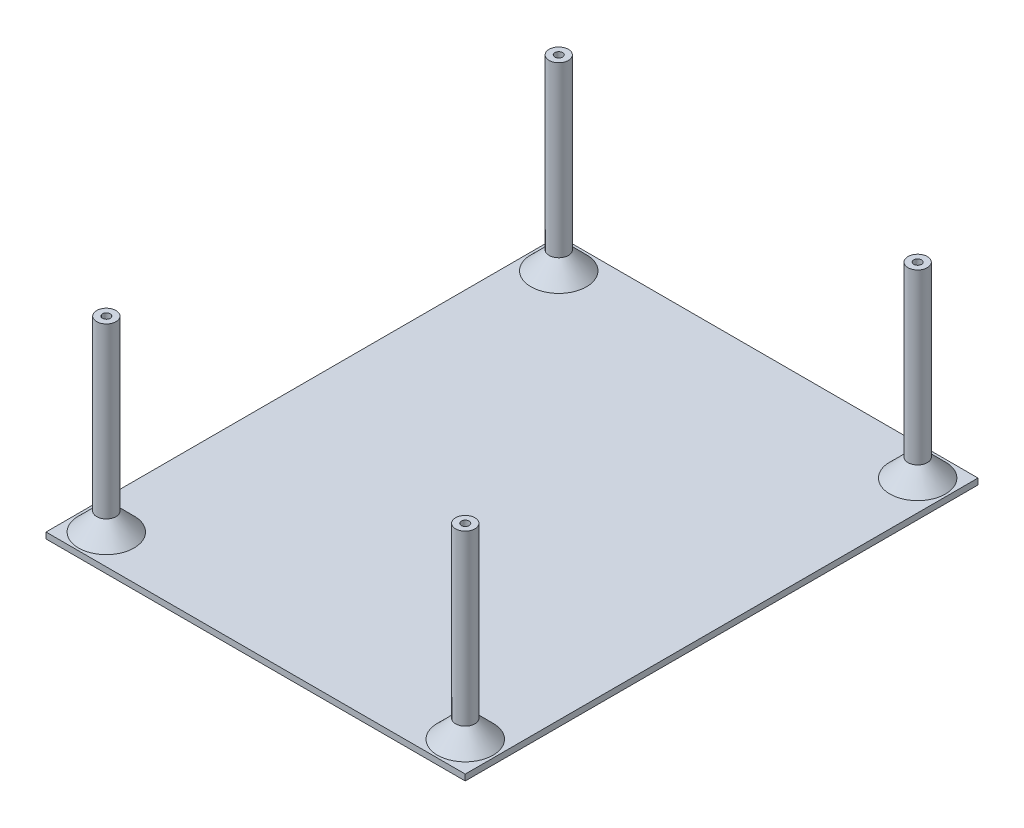
ISO-10303-21;
HEADER;
FILE_DESCRIPTION(('STEP AP214'),'2;1');
FILE_NAME('part.step','',(''),(''),'','','');
FILE_SCHEMA(('AUTOMOTIVE_DESIGN { 1 0 10303 214 1 1 1 1 }'));
ENDSEC;
DATA;
#1=APPLICATION_CONTEXT('core data for automotive mechanical design processes');
#2=APPLICATION_PROTOCOL_DEFINITION('international standard','automotive_design',2000,#1);
#3=PRODUCT_CONTEXT('',#1,'mechanical');
#4=PRODUCT('Part','Part','',(#3));
#5=PRODUCT_RELATED_PRODUCT_CATEGORY('part','',(#4));
#6=PRODUCT_DEFINITION_FORMATION('','',#4);
#7=PRODUCT_DEFINITION_CONTEXT('part definition',#1,'design');
#8=PRODUCT_DEFINITION('design','',#6,#7);
#9=PRODUCT_DEFINITION_SHAPE('','',#8);
#10=(LENGTH_UNIT() NAMED_UNIT(*) SI_UNIT(.MILLI.,.METRE.));
#11=(NAMED_UNIT(*) PLANE_ANGLE_UNIT() SI_UNIT($,.RADIAN.));
#12=(NAMED_UNIT(*) SI_UNIT($,.STERADIAN.) SOLID_ANGLE_UNIT());
#13=UNCERTAINTY_MEASURE_WITH_UNIT(LENGTH_MEASURE(1.E-05),#10,'distance_accuracy_value','');
#14=(GEOMETRIC_REPRESENTATION_CONTEXT(3) GLOBAL_UNCERTAINTY_ASSIGNED_CONTEXT((#13)) GLOBAL_UNIT_ASSIGNED_CONTEXT((#10,
#11,#12)) REPRESENTATION_CONTEXT('',''));
#15=CARTESIAN_POINT('',(0.,0.,0.));
#16=DIRECTION('',(0.,0.,1.));
#17=DIRECTION('',(1.,0.,0.));
#18=AXIS2_PLACEMENT_3D('',#15,#16,#17);
#19=CARTESIAN_POINT('',(-28.6506550218341,1.,-32.806768558952));
#20=DIRECTION('',(1.,0.,0.));
#21=DIRECTION('',(0.,0.,-1.));
#22=AXIS2_PLACEMENT_3D('',#19,#20,#21);
#23=PLANE('',#22);
#24=DIRECTION('',(0.,0.,1.));
#25=VECTOR('',#24,1.);
#26=CARTESIAN_POINT('',(-28.6506550218341,0.,-32.806768558952));
#27=LINE('',#26,#25);
#28=CARTESIAN_POINT('',(-28.6506550218341,0.,-32.806768558952));
#29=VERTEX_POINT('',#28);
#30=CARTESIAN_POINT('',(-28.650655021834,0.,52.193231441048));
#31=VERTEX_POINT('',#30);
#32=EDGE_CURVE('E104',#29,#31,#27,.T.);
#33=ORIENTED_EDGE('',*,*,#32,.T.);
#34=DIRECTION('',(0.,-1.,0.));
#35=VECTOR('',#34,1.);
#36=CARTESIAN_POINT('',(-28.650655021834,1.,52.193231441048));
#37=LINE('',#36,#35);
#38=CARTESIAN_POINT('',(-28.650655021834,1.,52.193231441048));
#39=VERTEX_POINT('',#38);
#40=EDGE_CURVE('E95',#39,#31,#37,.T.);
#41=ORIENTED_EDGE('',*,*,#40,.F.);
#42=DIRECTION('',(0.,0.,1.));
#43=VECTOR('',#42,1.);
#44=CARTESIAN_POINT('',(-28.6506550218341,1.,-32.806768558952));
#45=LINE('',#44,#43);
#46=CARTESIAN_POINT('',(-28.6506550218341,1.,-32.806768558952));
#47=VERTEX_POINT('',#46);
#48=EDGE_CURVE('E89',#47,#39,#45,.T.);
#49=ORIENTED_EDGE('',*,*,#48,.F.);
#50=DIRECTION('',(0.,-1.,0.));
#51=VECTOR('',#50,1.);
#52=CARTESIAN_POINT('',(-28.6506550218341,1.,-32.806768558952));
#53=LINE('',#52,#51);
#54=EDGE_CURVE('E100',#47,#29,#53,.T.);
#55=ORIENTED_EDGE('',*,*,#54,.T.);
#56=EDGE_LOOP('',(#33,#41,#49,#55));
#57=FACE_BOUND('',#56,.T.);
#58=ADVANCED_FACE('F36',(#57),#23,.F.);
#59=CARTESIAN_POINT('',(-28.650655021834,1.,52.193231441048));
#60=DIRECTION('',(0.,0.,-1.));
#61=DIRECTION('',(-1.,0.,0.));
#62=AXIS2_PLACEMENT_3D('',#59,#60,#61);
#63=PLANE('',#62);
#64=DIRECTION('',(1.,0.,0.));
#65=VECTOR('',#64,1.);
#66=CARTESIAN_POINT('',(-28.650655021834,0.,52.193231441048));
#67=LINE('',#66,#65);
#68=CARTESIAN_POINT('',(40.849344978166,0.,52.193231441048));
#69=VERTEX_POINT('',#68);
#70=EDGE_CURVE('E94',#31,#69,#67,.T.);
#71=ORIENTED_EDGE('',*,*,#70,.T.);
#72=DIRECTION('',(0.,-1.,0.));
#73=VECTOR('',#72,1.);
#74=CARTESIAN_POINT('',(40.849344978166,1.,52.193231441048));
#75=LINE('',#74,#73);
#76=CARTESIAN_POINT('',(40.849344978166,1.,52.193231441048));
#77=VERTEX_POINT('',#76);
#78=EDGE_CURVE('E92',#77,#69,#75,.T.);
#79=ORIENTED_EDGE('',*,*,#78,.F.);
#80=DIRECTION('',(1.,0.,0.));
#81=VECTOR('',#80,1.);
#82=CARTESIAN_POINT('',(-28.650655021834,1.,52.193231441048));
#83=LINE('',#82,#81);
#84=EDGE_CURVE('E84',#39,#77,#83,.T.);
#85=ORIENTED_EDGE('',*,*,#84,.F.);
#86=ORIENTED_EDGE('',*,*,#40,.T.);
#87=EDGE_LOOP('',(#71,#79,#85,#86));
#88=FACE_BOUND('',#87,.T.);
#89=ADVANCED_FACE('F93',(#88),#63,.F.);
#90=CARTESIAN_POINT('',(40.849344978166,1.,-32.806768558952));
#91=DIRECTION('',(-1.,0.,0.));
#92=DIRECTION('',(0.,0.,1.));
#93=AXIS2_PLACEMENT_3D('',#90,#91,#92);
#94=PLANE('',#93);
#95=DIRECTION('',(0.,0.,-1.));
#96=VECTOR('',#95,1.);
#97=CARTESIAN_POINT('',(40.849344978166,0.,-32.806768558952));
#98=LINE('',#97,#96);
#99=CARTESIAN_POINT('',(40.849344978166,0.,-32.806768558952));
#100=VERTEX_POINT('',#99);
#101=EDGE_CURVE('E70',#69,#100,#98,.T.);
#102=ORIENTED_EDGE('',*,*,#101,.T.);
#103=DIRECTION('',(0.,-1.,0.));
#104=VECTOR('',#103,1.);
#105=CARTESIAN_POINT('',(40.849344978166,1.,-32.806768558952));
#106=LINE('',#105,#104);
#107=CARTESIAN_POINT('',(40.849344978166,1.,-32.806768558952));
#108=VERTEX_POINT('',#107);
#109=EDGE_CURVE('E96',#108,#100,#106,.T.);
#110=ORIENTED_EDGE('',*,*,#109,.F.);
#111=DIRECTION('',(0.,0.,-1.));
#112=VECTOR('',#111,1.);
#113=CARTESIAN_POINT('',(40.849344978166,1.,-32.806768558952));
#114=LINE('',#113,#112);
#115=EDGE_CURVE('E87',#77,#108,#114,.T.);
#116=ORIENTED_EDGE('',*,*,#115,.F.);
#117=ORIENTED_EDGE('',*,*,#78,.T.);
#118=EDGE_LOOP('',(#102,#110,#116,#117));
#119=FACE_BOUND('',#118,.T.);
#120=ADVANCED_FACE('F98',(#119),#94,.F.);
#121=CARTESIAN_POINT('',(-28.6506550218341,1.,-32.806768558952));
#122=DIRECTION('',(0.,0.,1.));
#123=DIRECTION('',(1.,0.,0.));
#124=AXIS2_PLACEMENT_3D('',#121,#122,#123);
#125=PLANE('',#124);
#126=DIRECTION('',(-1.,0.,0.));
#127=VECTOR('',#126,1.);
#128=CARTESIAN_POINT('',(-28.6506550218341,0.,-32.806768558952));
#129=LINE('',#128,#127);
#130=EDGE_CURVE('E76',#100,#29,#129,.T.);
#131=ORIENTED_EDGE('',*,*,#130,.T.);
#132=ORIENTED_EDGE('',*,*,#54,.F.);
#133=DIRECTION('',(-1.,0.,0.));
#134=VECTOR('',#133,1.);
#135=CARTESIAN_POINT('',(-28.6506550218341,1.,-32.806768558952));
#136=LINE('',#135,#134);
#137=EDGE_CURVE('E53',#108,#47,#136,.T.);
#138=ORIENTED_EDGE('',*,*,#137,.F.);
#139=ORIENTED_EDGE('',*,*,#109,.T.);
#140=EDGE_LOOP('',(#131,#132,#138,#139));
#141=FACE_BOUND('',#140,.T.);
#142=ADVANCED_FACE('F246',(#141),#125,.F.);
#143=CARTESIAN_POINT('',(0.,1.,0.));
#144=DIRECTION('',(0.,1.,0.));
#145=DIRECTION('',(0.,0.,1.));
#146=AXIS2_PLACEMENT_3D('',#143,#144,#145);
#147=PLANE('',#146);
#148=CARTESIAN_POINT('',(-23.6506550218341,1.,-27.806768558952));
#149=DIRECTION('',(0.,1.,0.));
#150=DIRECTION('',(0.,0.,1.));
#151=AXIS2_PLACEMENT_3D('',#148,#149,#150);
#152=CIRCLE('',#151,4.60000000000001);
#153=CARTESIAN_POINT('',(-23.6506550218341,1.,-23.2067685589519));
#154=VERTEX_POINT('',#153);
#155=EDGE_CURVE('E126',#154,#154,#152,.F.);
#156=ORIENTED_EDGE('',*,*,#155,.T.);
#157=EDGE_LOOP('',(#156));
#158=FACE_BOUND('',#157,.T.);
#159=CARTESIAN_POINT('',(35.849344978166,1.,-27.806768558952));
#160=DIRECTION('',(0.,1.,0.));
#161=DIRECTION('',(0.,0.,1.));
#162=AXIS2_PLACEMENT_3D('',#159,#160,#161);
#163=CIRCLE('',#162,4.60000000000001);
#164=CARTESIAN_POINT('',(35.849344978166,1.,-23.2067685589519));
#165=VERTEX_POINT('',#164);
#166=EDGE_CURVE('E123',#165,#165,#163,.F.);
#167=ORIENTED_EDGE('',*,*,#166,.T.);
#168=EDGE_LOOP('',(#167));
#169=FACE_BOUND('',#168,.T.);
#170=CARTESIAN_POINT('',(-23.6506550218341,1.,47.1932314410481));
#171=DIRECTION('',(0.,1.,0.));
#172=DIRECTION('',(0.,0.,1.));
#173=AXIS2_PLACEMENT_3D('',#170,#171,#172);
#174=CIRCLE('',#173,4.6);
#175=CARTESIAN_POINT('',(-23.6506550218341,1.,51.7932314410481));
#176=VERTEX_POINT('',#175);
#177=EDGE_CURVE('E120',#176,#176,#174,.F.);
#178=ORIENTED_EDGE('',*,*,#177,.T.);
#179=EDGE_LOOP('',(#178));
#180=FACE_BOUND('',#179,.T.);
#181=CARTESIAN_POINT('',(35.849344978166,1.,47.193231441048));
#182=DIRECTION('',(0.,1.,0.));
#183=DIRECTION('',(0.,0.,1.));
#184=AXIS2_PLACEMENT_3D('',#181,#182,#183);
#185=CIRCLE('',#184,4.60000000000001);
#186=CARTESIAN_POINT('',(35.849344978166,1.,51.7932314410481));
#187=VERTEX_POINT('',#186);
#188=EDGE_CURVE('E117',#187,#187,#185,.F.);
#189=ORIENTED_EDGE('',*,*,#188,.T.);
#190=EDGE_LOOP('',(#189));
#191=FACE_BOUND('',#190,.T.);
#192=ORIENTED_EDGE('',*,*,#48,.T.);
#193=ORIENTED_EDGE('',*,*,#84,.T.);
#194=ORIENTED_EDGE('',*,*,#115,.T.);
#195=ORIENTED_EDGE('',*,*,#137,.T.);
#196=EDGE_LOOP('',(#192,#193,#194,#195));
#197=FACE_BOUND('',#196,.T.);
#198=ADVANCED_FACE('F85',(#158,#169,#180,#191,#197),#147,.T.);
#199=CARTESIAN_POINT('',(0.,0.,0.));
#200=DIRECTION('',(0.,1.,0.));
#201=DIRECTION('',(0.,0.,1.));
#202=AXIS2_PLACEMENT_3D('',#199,#200,#201);
#203=PLANE('',#202);
#204=ORIENTED_EDGE('',*,*,#32,.F.);
#205=ORIENTED_EDGE('',*,*,#130,.F.);
#206=ORIENTED_EDGE('',*,*,#101,.F.);
#207=ORIENTED_EDGE('',*,*,#70,.F.);
#208=EDGE_LOOP('',(#204,#205,#206,#207));
#209=FACE_BOUND('',#208,.T.);
#210=ADVANCED_FACE('F176',(#209),#203,.F.);
#211=CARTESIAN_POINT('',(-23.6506550218341,32.,-27.806768558952));
#212=DIRECTION('',(0.,-1.,0.));
#213=DIRECTION('',(0.,0.,-1.));
#214=AXIS2_PLACEMENT_3D('',#211,#212,#213);
#215=CYLINDRICAL_SURFACE('',#214,1.6);
#216=CARTESIAN_POINT('',(-23.6506550218341,4.00000000000003,-27.806768558952));
#217=DIRECTION('',(0.,1.,0.));
#218=DIRECTION('',(0.,0.,1.));
#219=AXIS2_PLACEMENT_3D('',#216,#217,#218);
#220=CIRCLE('',#219,1.6);
#221=CARTESIAN_POINT('',(-23.6506550218341,4.00000000000003,-26.206768558952));
#222=VERTEX_POINT('',#221);
#223=EDGE_CURVE('E114',#222,#222,#220,.T.);
#224=ORIENTED_EDGE('',*,*,#223,.T.);
#225=EDGE_LOOP('',(#224));
#226=FACE_BOUND('',#225,.T.);
#227=CARTESIAN_POINT('',(-23.6506550218341,32.,-27.806768558952));
#228=DIRECTION('',(0.,1.,0.));
#229=DIRECTION('',(0.,0.,1.));
#230=AXIS2_PLACEMENT_3D('',#227,#228,#229);
#231=CIRCLE('',#230,1.6);
#232=CARTESIAN_POINT('',(-23.6506550218341,32.,-26.206768558952));
#233=VERTEX_POINT('',#232);
#234=EDGE_CURVE('E107',#233,#233,#231,.T.);
#235=ORIENTED_EDGE('',*,*,#234,.F.);
#236=EDGE_LOOP('',(#235));
#237=FACE_BOUND('',#236,.T.);
#238=ADVANCED_FACE('F172',(#226,#237),#215,.T.);
#239=CARTESIAN_POINT('',(-23.6506550218341,32.,-27.806768558952));
#240=DIRECTION('',(0.,1.,0.));
#241=DIRECTION('',(0.,0.,1.));
#242=AXIS2_PLACEMENT_3D('',#239,#240,#241);
#243=PLANE('',#242);
#244=CARTESIAN_POINT('',(-23.6506550218341,32.,-27.806768558952));
#245=DIRECTION('',(0.,1.,0.));
#246=DIRECTION('',(0.,0.,1.));
#247=AXIS2_PLACEMENT_3D('',#244,#245,#246);
#248=CIRCLE('',#247,0.650000000000001);
#249=CARTESIAN_POINT('',(-23.6506550218341,32.,-27.156768558952));
#250=VERTEX_POINT('',#249);
#251=EDGE_CURVE('E199',#250,#250,#248,.T.);
#252=ORIENTED_EDGE('',*,*,#251,.F.);
#253=EDGE_LOOP('',(#252));
#254=FACE_BOUND('',#253,.T.);
#255=ORIENTED_EDGE('',*,*,#234,.T.);
#256=EDGE_LOOP('',(#255));
#257=FACE_BOUND('',#256,.T.);
#258=ADVANCED_FACE('F175',(#254,#257),#243,.T.);
#259=CARTESIAN_POINT('',(35.849344978166,32.,-27.806768558952));
#260=DIRECTION('',(0.,-1.,0.));
#261=DIRECTION('',(0.,0.,-1.));
#262=AXIS2_PLACEMENT_3D('',#259,#260,#261);
#263=CYLINDRICAL_SURFACE('',#262,1.6);
#264=CARTESIAN_POINT('',(35.849344978166,4.00000000000003,-27.806768558952));
#265=DIRECTION('',(0.,1.,0.));
#266=DIRECTION('',(0.,0.,1.));
#267=AXIS2_PLACEMENT_3D('',#264,#265,#266);
#268=CIRCLE('',#267,1.6);
#269=CARTESIAN_POINT('',(35.849344978166,4.00000000000003,-26.206768558952));
#270=VERTEX_POINT('',#269);
#271=EDGE_CURVE('E129',#270,#270,#268,.T.);
#272=ORIENTED_EDGE('',*,*,#271,.T.);
#273=EDGE_LOOP('',(#272));
#274=FACE_BOUND('',#273,.T.);
#275=CARTESIAN_POINT('',(35.849344978166,32.,-27.806768558952));
#276=DIRECTION('',(0.,1.,0.));
#277=DIRECTION('',(0.,0.,1.));
#278=AXIS2_PLACEMENT_3D('',#275,#276,#277);
#279=CIRCLE('',#278,1.6);
#280=CARTESIAN_POINT('',(35.849344978166,32.,-26.206768558952));
#281=VERTEX_POINT('',#280);
#282=EDGE_CURVE('E181',#281,#281,#279,.T.);
#283=ORIENTED_EDGE('',*,*,#282,.F.);
#284=EDGE_LOOP('',(#283));
#285=FACE_BOUND('',#284,.T.);
#286=ADVANCED_FACE('F230',(#274,#285),#263,.T.);
#287=CARTESIAN_POINT('',(35.849344978166,32.,-27.806768558952));
#288=DIRECTION('',(0.,1.,0.));
#289=DIRECTION('',(0.,0.,1.));
#290=AXIS2_PLACEMENT_3D('',#287,#288,#289);
#291=PLANE('',#290);
#292=CARTESIAN_POINT('',(35.849344978166,32.,-27.806768558952));
#293=DIRECTION('',(0.,1.,0.));
#294=DIRECTION('',(0.,0.,1.));
#295=AXIS2_PLACEMENT_3D('',#292,#293,#294);
#296=CIRCLE('',#295,0.649999999999997);
#297=CARTESIAN_POINT('',(35.849344978166,32.,-27.156768558952));
#298=VERTEX_POINT('',#297);
#299=EDGE_CURVE('E211',#298,#298,#296,.T.);
#300=ORIENTED_EDGE('',*,*,#299,.F.);
#301=EDGE_LOOP('',(#300));
#302=FACE_BOUND('',#301,.T.);
#303=ORIENTED_EDGE('',*,*,#282,.T.);
#304=EDGE_LOOP('',(#303));
#305=FACE_BOUND('',#304,.T.);
#306=ADVANCED_FACE('F226',(#302,#305),#291,.T.);
#307=CARTESIAN_POINT('',(35.849344978166,32.,47.193231441048));
#308=DIRECTION('',(0.,-1.,0.));
#309=DIRECTION('',(0.,0.,-1.));
#310=AXIS2_PLACEMENT_3D('',#307,#308,#309);
#311=CYLINDRICAL_SURFACE('',#310,1.6);
#312=CARTESIAN_POINT('',(35.849344978166,4.00000000000003,47.193231441048));
#313=DIRECTION('',(0.,1.,0.));
#314=DIRECTION('',(0.,0.,1.));
#315=AXIS2_PLACEMENT_3D('',#312,#313,#314);
#316=CIRCLE('',#315,1.6);
#317=CARTESIAN_POINT('',(35.849344978166,4.00000000000003,48.793231441048));
#318=VERTEX_POINT('',#317);
#319=EDGE_CURVE('E11',#318,#318,#316,.T.);
#320=ORIENTED_EDGE('',*,*,#319,.T.);
#321=EDGE_LOOP('',(#320));
#322=FACE_BOUND('',#321,.T.);
#323=CARTESIAN_POINT('',(35.849344978166,32.,47.193231441048));
#324=DIRECTION('',(0.,1.,0.));
#325=DIRECTION('',(0.,0.,1.));
#326=AXIS2_PLACEMENT_3D('',#323,#324,#325);
#327=CIRCLE('',#326,1.6);
#328=CARTESIAN_POINT('',(35.849344978166,32.,48.793231441048));
#329=VERTEX_POINT('',#328);
#330=EDGE_CURVE('E184',#329,#329,#327,.T.);
#331=ORIENTED_EDGE('',*,*,#330,.F.);
#332=EDGE_LOOP('',(#331));
#333=FACE_BOUND('',#332,.T.);
#334=ADVANCED_FACE('F229',(#322,#333),#311,.T.);
#335=CARTESIAN_POINT('',(35.849344978166,32.,47.193231441048));
#336=DIRECTION('',(0.,1.,0.));
#337=DIRECTION('',(0.,0.,1.));
#338=AXIS2_PLACEMENT_3D('',#335,#336,#337);
#339=PLANE('',#338);
#340=CARTESIAN_POINT('',(35.849344978166,32.,47.193231441048));
#341=DIRECTION('',(0.,1.,0.));
#342=DIRECTION('',(0.,0.,1.));
#343=AXIS2_PLACEMENT_3D('',#340,#341,#342);
#344=CIRCLE('',#343,0.649999999999997);
#345=CARTESIAN_POINT('',(35.849344978166,32.,47.843231441048));
#346=VERTEX_POINT('',#345);
#347=EDGE_CURVE('E205',#346,#346,#344,.T.);
#348=ORIENTED_EDGE('',*,*,#347,.F.);
#349=EDGE_LOOP('',(#348));
#350=FACE_BOUND('',#349,.T.);
#351=ORIENTED_EDGE('',*,*,#330,.T.);
#352=EDGE_LOOP('',(#351));
#353=FACE_BOUND('',#352,.T.);
#354=ADVANCED_FACE('F292',(#350,#353),#339,.T.);
#355=CARTESIAN_POINT('',(-23.6506550218341,32.,47.1932314410481));
#356=DIRECTION('',(0.,-1.,0.));
#357=DIRECTION('',(0.,0.,-1.));
#358=AXIS2_PLACEMENT_3D('',#355,#356,#357);
#359=CYLINDRICAL_SURFACE('',#358,1.6);
#360=CARTESIAN_POINT('',(-23.6506550218341,4.00000000000003,47.1932314410481));
#361=DIRECTION('',(0.,1.,0.));
#362=DIRECTION('',(0.,0.,1.));
#363=AXIS2_PLACEMENT_3D('',#360,#361,#362);
#364=CIRCLE('',#363,1.6);
#365=CARTESIAN_POINT('',(-23.6506550218341,4.00000000000003,48.7932314410481));
#366=VERTEX_POINT('',#365);
#367=EDGE_CURVE('E45',#366,#366,#364,.T.);
#368=ORIENTED_EDGE('',*,*,#367,.T.);
#369=EDGE_LOOP('',(#368));
#370=FACE_BOUND('',#369,.T.);
#371=CARTESIAN_POINT('',(-23.6506550218341,32.,47.1932314410481));
#372=DIRECTION('',(0.,1.,0.));
#373=DIRECTION('',(0.,0.,1.));
#374=AXIS2_PLACEMENT_3D('',#371,#372,#373);
#375=CIRCLE('',#374,1.6);
#376=CARTESIAN_POINT('',(-23.6506550218341,32.,48.7932314410481));
#377=VERTEX_POINT('',#376);
#378=EDGE_CURVE('E189',#377,#377,#375,.T.);
#379=ORIENTED_EDGE('',*,*,#378,.F.);
#380=EDGE_LOOP('',(#379));
#381=FACE_BOUND('',#380,.T.);
#382=ADVANCED_FACE('F134',(#370,#381),#359,.T.);
#383=CARTESIAN_POINT('',(-23.6506550218341,32.,47.1932314410481));
#384=DIRECTION('',(0.,1.,0.));
#385=DIRECTION('',(0.,0.,1.));
#386=AXIS2_PLACEMENT_3D('',#383,#384,#385);
#387=PLANE('',#386);
#388=CARTESIAN_POINT('',(-23.6506550218341,32.,47.1932314410481));
#389=DIRECTION('',(0.,1.,0.));
#390=DIRECTION('',(0.,0.,1.));
#391=AXIS2_PLACEMENT_3D('',#388,#389,#390);
#392=CIRCLE('',#391,0.65);
#393=CARTESIAN_POINT('',(-23.6506550218341,32.,47.8432314410481));
#394=VERTEX_POINT('',#393);
#395=EDGE_CURVE('E193',#394,#394,#392,.T.);
#396=ORIENTED_EDGE('',*,*,#395,.F.);
#397=EDGE_LOOP('',(#396));
#398=FACE_BOUND('',#397,.T.);
#399=ORIENTED_EDGE('',*,*,#378,.T.);
#400=EDGE_LOOP('',(#399));
#401=FACE_BOUND('',#400,.T.);
#402=ADVANCED_FACE('F304',(#398,#401),#387,.T.);
#403=CARTESIAN_POINT('',(-23.6506550218341,27.,47.1932314410481));
#404=DIRECTION('',(0.,1.,0.));
#405=DIRECTION('',(0.,0.,1.));
#406=AXIS2_PLACEMENT_3D('',#403,#404,#405);
#407=CYLINDRICAL_SURFACE('',#406,0.65);
#408=CARTESIAN_POINT('',(-23.6506550218341,27.,47.1932314410481));
#409=DIRECTION('',(0.,1.,0.));
#410=DIRECTION('',(0.,0.,1.));
#411=AXIS2_PLACEMENT_3D('',#408,#409,#410);
#412=CIRCLE('',#411,0.65);
#413=CARTESIAN_POINT('',(-23.6506550218341,27.,47.8432314410481));
#414=VERTEX_POINT('',#413);
#415=EDGE_CURVE('E192',#414,#414,#412,.T.);
#416=ORIENTED_EDGE('',*,*,#415,.F.);
#417=EDGE_LOOP('',(#416));
#418=FACE_BOUND('',#417,.T.);
#419=ORIENTED_EDGE('',*,*,#395,.T.);
#420=EDGE_LOOP('',(#419));
#421=FACE_BOUND('',#420,.T.);
#422=ADVANCED_FACE('F309',(#418,#421),#407,.F.);
#423=CARTESIAN_POINT('',(-23.6506550218341,27.,47.1932314410481));
#424=DIRECTION('',(0.,1.,0.));
#425=DIRECTION('',(0.,0.,1.));
#426=AXIS2_PLACEMENT_3D('',#423,#424,#425);
#427=PLANE('',#426);
#428=ORIENTED_EDGE('',*,*,#415,.T.);
#429=EDGE_LOOP('',(#428));
#430=FACE_BOUND('',#429,.T.);
#431=ADVANCED_FACE('F319',(#430),#427,.T.);
#432=CARTESIAN_POINT('',(35.849344978166,27.,47.193231441048));
#433=DIRECTION('',(0.,1.,0.));
#434=DIRECTION('',(0.,0.,1.));
#435=AXIS2_PLACEMENT_3D('',#432,#433,#434);
#436=CYLINDRICAL_SURFACE('',#435,0.649999999999997);
#437=CARTESIAN_POINT('',(35.849344978166,27.,47.193231441048));
#438=DIRECTION('',(0.,1.,0.));
#439=DIRECTION('',(0.,0.,1.));
#440=AXIS2_PLACEMENT_3D('',#437,#438,#439);
#441=CIRCLE('',#440,0.649999999999997);
#442=CARTESIAN_POINT('',(35.849344978166,27.,47.843231441048));
#443=VERTEX_POINT('',#442);
#444=EDGE_CURVE('E208',#443,#443,#441,.T.);
#445=ORIENTED_EDGE('',*,*,#444,.F.);
#446=EDGE_LOOP('',(#445));
#447=FACE_BOUND('',#446,.T.);
#448=ORIENTED_EDGE('',*,*,#347,.T.);
#449=EDGE_LOOP('',(#448));
#450=FACE_BOUND('',#449,.T.);
#451=ADVANCED_FACE('F329',(#447,#450),#436,.F.);
#452=CARTESIAN_POINT('',(35.849344978166,27.,47.193231441048));
#453=DIRECTION('',(0.,1.,0.));
#454=DIRECTION('',(0.,0.,1.));
#455=AXIS2_PLACEMENT_3D('',#452,#453,#454);
#456=PLANE('',#455);
#457=ORIENTED_EDGE('',*,*,#444,.T.);
#458=EDGE_LOOP('',(#457));
#459=FACE_BOUND('',#458,.T.);
#460=ADVANCED_FACE('F222',(#459),#456,.T.);
#461=CARTESIAN_POINT('',(35.849344978166,27.,-27.806768558952));
#462=DIRECTION('',(0.,1.,0.));
#463=DIRECTION('',(0.,0.,1.));
#464=AXIS2_PLACEMENT_3D('',#461,#462,#463);
#465=CYLINDRICAL_SURFACE('',#464,0.649999999999997);
#466=CARTESIAN_POINT('',(35.849344978166,27.,-27.806768558952));
#467=DIRECTION('',(0.,1.,0.));
#468=DIRECTION('',(0.,0.,1.));
#469=AXIS2_PLACEMENT_3D('',#466,#467,#468);
#470=CIRCLE('',#469,0.649999999999997);
#471=CARTESIAN_POINT('',(35.849344978166,27.,-27.156768558952));
#472=VERTEX_POINT('',#471);
#473=EDGE_CURVE('E196',#472,#472,#470,.T.);
#474=ORIENTED_EDGE('',*,*,#473,.F.);
#475=EDGE_LOOP('',(#474));
#476=FACE_BOUND('',#475,.T.);
#477=ORIENTED_EDGE('',*,*,#299,.T.);
#478=EDGE_LOOP('',(#477));
#479=FACE_BOUND('',#478,.T.);
#480=ADVANCED_FACE('F219',(#476,#479),#465,.F.);
#481=CARTESIAN_POINT('',(35.849344978166,27.,-27.806768558952));
#482=DIRECTION('',(0.,1.,0.));
#483=DIRECTION('',(0.,0.,1.));
#484=AXIS2_PLACEMENT_3D('',#481,#482,#483);
#485=PLANE('',#484);
#486=ORIENTED_EDGE('',*,*,#473,.T.);
#487=EDGE_LOOP('',(#486));
#488=FACE_BOUND('',#487,.T.);
#489=ADVANCED_FACE('F217',(#488),#485,.T.);
#490=CARTESIAN_POINT('',(-23.6506550218341,27.,-27.806768558952));
#491=DIRECTION('',(0.,1.,0.));
#492=DIRECTION('',(0.,0.,1.));
#493=AXIS2_PLACEMENT_3D('',#490,#491,#492);
#494=CYLINDRICAL_SURFACE('',#493,0.650000000000001);
#495=CARTESIAN_POINT('',(-23.6506550218341,27.,-27.806768558952));
#496=DIRECTION('',(0.,1.,0.));
#497=DIRECTION('',(0.,0.,1.));
#498=AXIS2_PLACEMENT_3D('',#495,#496,#497);
#499=CIRCLE('',#498,0.650000000000001);
#500=CARTESIAN_POINT('',(-23.6506550218341,27.,-27.156768558952));
#501=VERTEX_POINT('',#500);
#502=EDGE_CURVE('E202',#501,#501,#499,.T.);
#503=ORIENTED_EDGE('',*,*,#502,.F.);
#504=EDGE_LOOP('',(#503));
#505=FACE_BOUND('',#504,.T.);
#506=ORIENTED_EDGE('',*,*,#251,.T.);
#507=EDGE_LOOP('',(#506));
#508=FACE_BOUND('',#507,.T.);
#509=ADVANCED_FACE('F165',(#505,#508),#494,.F.);
#510=CARTESIAN_POINT('',(-23.6506550218341,27.,-27.806768558952));
#511=DIRECTION('',(0.,1.,0.));
#512=DIRECTION('',(0.,0.,1.));
#513=AXIS2_PLACEMENT_3D('',#510,#511,#512);
#514=PLANE('',#513);
#515=ORIENTED_EDGE('',*,*,#502,.T.);
#516=EDGE_LOOP('',(#515));
#517=FACE_BOUND('',#516,.T.);
#518=ADVANCED_FACE('F160',(#517),#514,.T.);
#519=CARTESIAN_POINT('',(-23.6506550218341,4.00000000000003,-27.806768558952));
#520=DIRECTION('',(0.,-1.,0.));
#521=DIRECTION('',(0.,0.,-1.));
#522=AXIS2_PLACEMENT_3D('',#519,#520,#521);
#523=CONICAL_SURFACE('',#522,1.6,0.785398163397445);
#524=ORIENTED_EDGE('',*,*,#155,.F.);
#525=EDGE_LOOP('',(#524));
#526=FACE_BOUND('',#525,.T.);
#527=ORIENTED_EDGE('',*,*,#223,.F.);
#528=EDGE_LOOP('',(#527));
#529=FACE_BOUND('',#528,.T.);
#530=ADVANCED_FACE('F146',(#526,#529),#523,.T.);
#531=CARTESIAN_POINT('',(35.849344978166,4.00000000000003,-27.806768558952));
#532=DIRECTION('',(0.,-1.,0.));
#533=DIRECTION('',(0.,0.,-1.));
#534=AXIS2_PLACEMENT_3D('',#531,#532,#533);
#535=CONICAL_SURFACE('',#534,1.6,0.785398163397444);
#536=ORIENTED_EDGE('',*,*,#166,.F.);
#537=EDGE_LOOP('',(#536));
#538=FACE_BOUND('',#537,.T.);
#539=ORIENTED_EDGE('',*,*,#271,.F.);
#540=EDGE_LOOP('',(#539));
#541=FACE_BOUND('',#540,.T.);
#542=ADVANCED_FACE('F139',(#538,#541),#535,.T.);
#543=CARTESIAN_POINT('',(-23.6506550218341,4.00000000000003,47.1932314410481));
#544=DIRECTION('',(0.,-1.,0.));
#545=DIRECTION('',(0.,0.,-1.));
#546=AXIS2_PLACEMENT_3D('',#543,#544,#545);
#547=CONICAL_SURFACE('',#546,1.6,0.785398163397443);
#548=ORIENTED_EDGE('',*,*,#177,.F.);
#549=EDGE_LOOP('',(#548));
#550=FACE_BOUND('',#549,.T.);
#551=ORIENTED_EDGE('',*,*,#367,.F.);
#552=EDGE_LOOP('',(#551));
#553=FACE_BOUND('',#552,.T.);
#554=ADVANCED_FACE('F137',(#550,#553),#547,.T.);
#555=CARTESIAN_POINT('',(35.849344978166,4.00000000000003,47.193231441048));
#556=DIRECTION('',(0.,-1.,0.));
#557=DIRECTION('',(0.,0.,-1.));
#558=AXIS2_PLACEMENT_3D('',#555,#556,#557);
#559=CONICAL_SURFACE('',#558,1.6,0.785398163397444);
#560=ORIENTED_EDGE('',*,*,#188,.F.);
#561=EDGE_LOOP('',(#560));
#562=FACE_BOUND('',#561,.T.);
#563=ORIENTED_EDGE('',*,*,#319,.F.);
#564=EDGE_LOOP('',(#563));
#565=FACE_BOUND('',#564,.T.);
#566=ADVANCED_FACE('F38',(#562,#565),#559,.T.);
#567=CLOSED_SHELL('',(#58,#89,#120,#142,#198,#210,#238,#258,#286,#306,#334,#354,#382,#402,#422,
#431,#451,#460,#480,#489,#509,#518,#530,#542,#554,#566));
#568=MANIFOLD_SOLID_BREP('B2',#567);
#569=ADVANCED_BREP_SHAPE_REPRESENTATION('',(#18,#568),#14);
#570=SHAPE_DEFINITION_REPRESENTATION(#9,#569);
ENDSEC;
END-ISO-10303-21;
